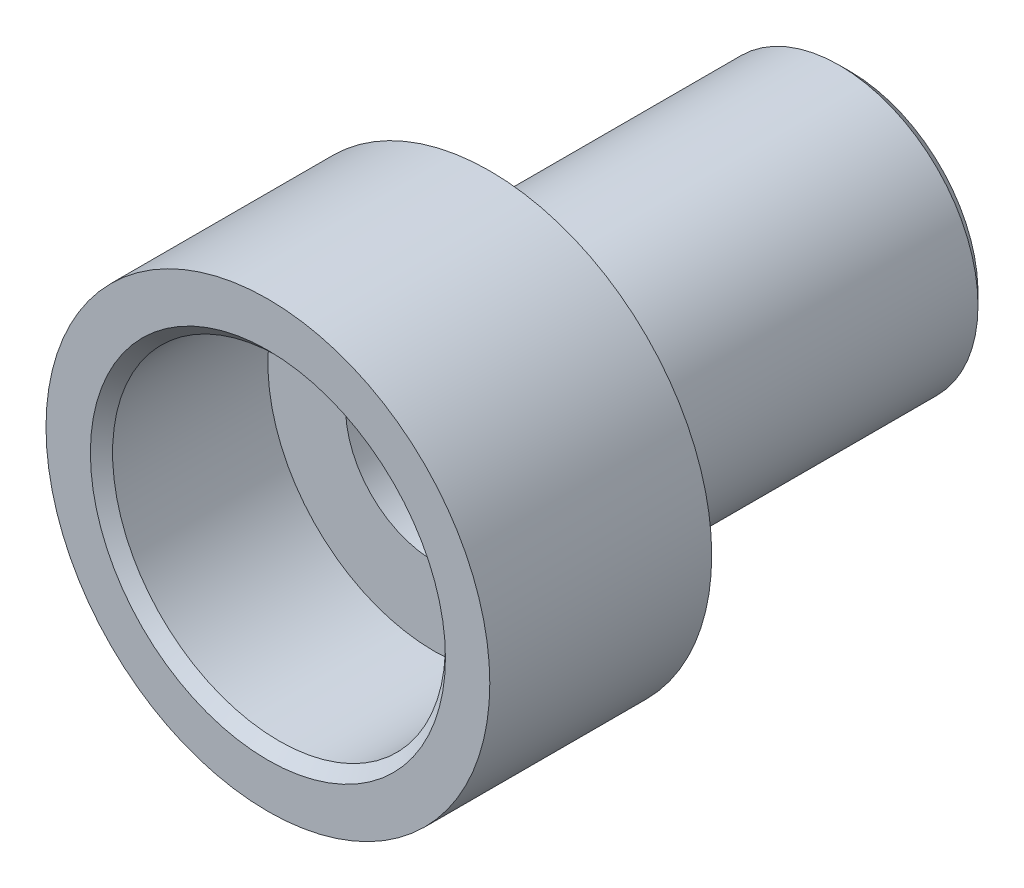
ISO-10303-21;
HEADER;
FILE_DESCRIPTION(('STEP AP214'),'2;1');
FILE_NAME('part.step','',(''),(''),'','','');
FILE_SCHEMA(('AUTOMOTIVE_DESIGN { 1 0 10303 214 1 1 1 1 }'));
ENDSEC;
DATA;
#1=APPLICATION_CONTEXT('core data for automotive mechanical design processes');
#2=APPLICATION_PROTOCOL_DEFINITION('international standard','automotive_design',2000,#1);
#3=PRODUCT_CONTEXT('',#1,'mechanical');
#4=PRODUCT('Part','Part','',(#3));
#5=PRODUCT_RELATED_PRODUCT_CATEGORY('part','',(#4));
#6=PRODUCT_DEFINITION_FORMATION('','',#4);
#7=PRODUCT_DEFINITION_CONTEXT('part definition',#1,'design');
#8=PRODUCT_DEFINITION('design','',#6,#7);
#9=PRODUCT_DEFINITION_SHAPE('','',#8);
#10=(LENGTH_UNIT() NAMED_UNIT(*) SI_UNIT(.MILLI.,.METRE.));
#11=(NAMED_UNIT(*) PLANE_ANGLE_UNIT() SI_UNIT($,.RADIAN.));
#12=(NAMED_UNIT(*) SI_UNIT($,.STERADIAN.) SOLID_ANGLE_UNIT());
#13=UNCERTAINTY_MEASURE_WITH_UNIT(LENGTH_MEASURE(1.E-05),#10,'distance_accuracy_value','');
#14=(GEOMETRIC_REPRESENTATION_CONTEXT(3) GLOBAL_UNCERTAINTY_ASSIGNED_CONTEXT((#13)) GLOBAL_UNIT_ASSIGNED_CONTEXT((#10,
#11,#12)) REPRESENTATION_CONTEXT('',''));
#15=CARTESIAN_POINT('',(0.,0.,0.));
#16=DIRECTION('',(0.,0.,1.));
#17=DIRECTION('',(1.,0.,0.));
#18=AXIS2_PLACEMENT_3D('',#15,#16,#17);
#19=CARTESIAN_POINT('',(36.5,36.5,4.));
#20=DIRECTION('',(0.,0.,-1.));
#21=DIRECTION('',(0.,1.,0.));
#22=AXIS2_PLACEMENT_3D('',#19,#20,#21);
#23=CYLINDRICAL_SURFACE('',#22,1.6);
#24=CARTESIAN_POINT('',(36.5,36.5,4.));
#25=DIRECTION('',(0.,0.,-1.));
#26=DIRECTION('',(0.,1.,0.));
#27=AXIS2_PLACEMENT_3D('',#24,#25,#26);
#28=CIRCLE('',#27,1.6);
#29=CARTESIAN_POINT('',(36.5,38.1,4.));
#30=VERTEX_POINT('',#29);
#31=EDGE_CURVE('E50',#30,#30,#28,.T.);
#32=ORIENTED_EDGE('',*,*,#31,.T.);
#33=EDGE_LOOP('',(#32));
#34=FACE_BOUND('',#33,.T.);
#35=CARTESIAN_POINT('',(36.5,36.5,11.5));
#36=DIRECTION('',(0.,0.,-1.));
#37=DIRECTION('',(0.,1.,0.));
#38=AXIS2_PLACEMENT_3D('',#35,#36,#37);
#39=CIRCLE('',#38,1.6);
#40=CARTESIAN_POINT('',(36.5,38.1,11.5));
#41=VERTEX_POINT('',#40);
#42=EDGE_CURVE('E65',#41,#41,#39,.T.);
#43=ORIENTED_EDGE('',*,*,#42,.F.);
#44=EDGE_LOOP('',(#43));
#45=FACE_BOUND('',#44,.T.);
#46=ADVANCED_FACE('F30',(#34,#45),#23,.F.);
#47=CARTESIAN_POINT('',(38.1,36.5,4.));
#48=DIRECTION('',(0.,0.,-1.));
#49=DIRECTION('',(0.,1.,0.));
#50=AXIS2_PLACEMENT_3D('',#47,#48,#49);
#51=PLANE('',#50);
#52=CARTESIAN_POINT('',(36.5,36.5,4.));
#53=DIRECTION('',(0.,0.,-1.));
#54=DIRECTION('',(0.,1.,0.));
#55=AXIS2_PLACEMENT_3D('',#52,#53,#54);
#56=CIRCLE('',#55,2.3);
#57=CARTESIAN_POINT('',(36.5,38.8,4.));
#58=VERTEX_POINT('',#57);
#59=EDGE_CURVE('E45',#58,#58,#56,.T.);
#60=ORIENTED_EDGE('',*,*,#59,.T.);
#61=EDGE_LOOP('',(#60));
#62=FACE_BOUND('',#61,.T.);
#63=ORIENTED_EDGE('',*,*,#31,.F.);
#64=EDGE_LOOP('',(#63));
#65=FACE_BOUND('',#64,.T.);
#66=ADVANCED_FACE('F73',(#62,#65),#51,.T.);
#67=CARTESIAN_POINT('',(36.5,36.5,4.));
#68=DIRECTION('',(0.,0.,-1.));
#69=DIRECTION('',(0.,1.,0.));
#70=AXIS2_PLACEMENT_3D('',#67,#68,#69);
#71=CYLINDRICAL_SURFACE('',#70,2.5);
#72=CARTESIAN_POINT('',(36.5,36.5,4.2));
#73=DIRECTION('',(0.,0.,-1.));
#74=DIRECTION('',(0.,1.,0.));
#75=AXIS2_PLACEMENT_3D('',#72,#73,#74);
#76=CIRCLE('',#75,2.5);
#77=CARTESIAN_POINT('',(36.5,39.,4.2));
#78=VERTEX_POINT('',#77);
#79=EDGE_CURVE('E41',#78,#78,#76,.F.);
#80=ORIENTED_EDGE('',*,*,#79,.T.);
#81=EDGE_LOOP('',(#80));
#82=FACE_BOUND('',#81,.T.);
#83=CARTESIAN_POINT('',(36.5,36.5,10.5));
#84=DIRECTION('',(0.,0.,-1.));
#85=DIRECTION('',(0.,1.,0.));
#86=AXIS2_PLACEMENT_3D('',#83,#84,#85);
#87=CIRCLE('',#86,2.5);
#88=CARTESIAN_POINT('',(36.5,39.,10.5));
#89=VERTEX_POINT('',#88);
#90=EDGE_CURVE('E53',#89,#89,#87,.T.);
#91=ORIENTED_EDGE('',*,*,#90,.T.);
#92=EDGE_LOOP('',(#91));
#93=FACE_BOUND('',#92,.T.);
#94=ADVANCED_FACE('F79',(#82,#93),#71,.T.);
#95=CARTESIAN_POINT('',(39.,36.5,10.5));
#96=DIRECTION('',(0.,0.,-1.));
#97=DIRECTION('',(0.,1.,0.));
#98=AXIS2_PLACEMENT_3D('',#95,#96,#97);
#99=PLANE('',#98);
#100=CARTESIAN_POINT('',(36.5,36.5,10.5));
#101=DIRECTION('',(0.,0.,-1.));
#102=DIRECTION('',(0.,1.,0.));
#103=AXIS2_PLACEMENT_3D('',#100,#101,#102);
#104=CIRCLE('',#103,4.);
#105=CARTESIAN_POINT('',(36.5,40.5,10.5));
#106=VERTEX_POINT('',#105);
#107=EDGE_CURVE('E56',#106,#106,#104,.T.);
#108=ORIENTED_EDGE('',*,*,#107,.T.);
#109=EDGE_LOOP('',(#108));
#110=FACE_BOUND('',#109,.T.);
#111=ORIENTED_EDGE('',*,*,#90,.F.);
#112=EDGE_LOOP('',(#111));
#113=FACE_BOUND('',#112,.T.);
#114=ADVANCED_FACE('F101',(#110,#113),#99,.T.);
#115=CARTESIAN_POINT('',(36.5,36.5,4.));
#116=DIRECTION('',(0.,0.,-1.));
#117=DIRECTION('',(0.,1.,0.));
#118=AXIS2_PLACEMENT_3D('',#115,#116,#117);
#119=CYLINDRICAL_SURFACE('',#118,4.);
#120=CARTESIAN_POINT('',(36.5,36.5,14.5));
#121=DIRECTION('',(0.,0.,-1.));
#122=DIRECTION('',(0.,1.,0.));
#123=AXIS2_PLACEMENT_3D('',#120,#121,#122);
#124=CIRCLE('',#123,4.);
#125=CARTESIAN_POINT('',(36.5,40.5,14.5));
#126=VERTEX_POINT('',#125);
#127=EDGE_CURVE('E59',#126,#126,#124,.T.);
#128=ORIENTED_EDGE('',*,*,#127,.T.);
#129=EDGE_LOOP('',(#128));
#130=FACE_BOUND('',#129,.T.);
#131=ORIENTED_EDGE('',*,*,#107,.F.);
#132=EDGE_LOOP('',(#131));
#133=FACE_BOUND('',#132,.T.);
#134=ADVANCED_FACE('F105',(#130,#133),#119,.T.);
#135=CARTESIAN_POINT('',(40.5,36.5,14.5));
#136=DIRECTION('',(0.,0.,1.));
#137=DIRECTION('',(0.,-1.,0.));
#138=AXIS2_PLACEMENT_3D('',#135,#136,#137);
#139=PLANE('',#138);
#140=CARTESIAN_POINT('',(36.5,36.5,14.5));
#141=DIRECTION('',(0.,0.,1.));
#142=DIRECTION('',(0.,-1.,0.));
#143=AXIS2_PLACEMENT_3D('',#140,#141,#142);
#144=CIRCLE('',#143,3.2);
#145=CARTESIAN_POINT('',(36.5,33.3,14.5));
#146=VERTEX_POINT('',#145);
#147=EDGE_CURVE('E37',#146,#146,#144,.F.);
#148=ORIENTED_EDGE('',*,*,#147,.T.);
#149=EDGE_LOOP('',(#148));
#150=FACE_BOUND('',#149,.T.);
#151=ORIENTED_EDGE('',*,*,#127,.F.);
#152=EDGE_LOOP('',(#151));
#153=FACE_BOUND('',#152,.T.);
#154=ADVANCED_FACE('F111',(#150,#153),#139,.T.);
#155=CARTESIAN_POINT('',(36.5,36.5,4.));
#156=DIRECTION('',(0.,0.,-1.));
#157=DIRECTION('',(0.,1.,0.));
#158=AXIS2_PLACEMENT_3D('',#155,#156,#157);
#159=CYLINDRICAL_SURFACE('',#158,3.);
#160=CARTESIAN_POINT('',(36.5,36.5,14.3));
#161=DIRECTION('',(0.,0.,1.));
#162=DIRECTION('',(0.,-1.,0.));
#163=AXIS2_PLACEMENT_3D('',#160,#161,#162);
#164=CIRCLE('',#163,3.);
#165=CARTESIAN_POINT('',(36.5,33.5,14.3));
#166=VERTEX_POINT('',#165);
#167=EDGE_CURVE('E10',#166,#166,#164,.T.);
#168=ORIENTED_EDGE('',*,*,#167,.T.);
#169=EDGE_LOOP('',(#168));
#170=FACE_BOUND('',#169,.T.);
#171=CARTESIAN_POINT('',(36.5,36.5,11.5));
#172=DIRECTION('',(0.,0.,-1.));
#173=DIRECTION('',(0.,1.,0.));
#174=AXIS2_PLACEMENT_3D('',#171,#172,#173);
#175=CIRCLE('',#174,3.);
#176=CARTESIAN_POINT('',(36.5,39.5,11.5));
#177=VERTEX_POINT('',#176);
#178=EDGE_CURVE('E62',#177,#177,#175,.T.);
#179=ORIENTED_EDGE('',*,*,#178,.T.);
#180=EDGE_LOOP('',(#179));
#181=FACE_BOUND('',#180,.T.);
#182=ADVANCED_FACE('F91',(#170,#181),#159,.F.);
#183=CARTESIAN_POINT('',(39.5,36.5,11.5));
#184=DIRECTION('',(0.,0.,1.));
#185=DIRECTION('',(0.,-1.,0.));
#186=AXIS2_PLACEMENT_3D('',#183,#184,#185);
#187=PLANE('',#186);
#188=ORIENTED_EDGE('',*,*,#42,.T.);
#189=EDGE_LOOP('',(#188));
#190=FACE_BOUND('',#189,.T.);
#191=ORIENTED_EDGE('',*,*,#178,.F.);
#192=EDGE_LOOP('',(#191));
#193=FACE_BOUND('',#192,.T.);
#194=ADVANCED_FACE('F69',(#190,#193),#187,.T.);
#195=CARTESIAN_POINT('',(36.5,36.5,4.));
#196=DIRECTION('',(0.,0.,1.));
#197=DIRECTION('',(0.,-1.,0.));
#198=AXIS2_PLACEMENT_3D('',#195,#196,#197);
#199=CONICAL_SURFACE('',#198,2.3,0.785398163397441);
#200=ORIENTED_EDGE('',*,*,#79,.F.);
#201=EDGE_LOOP('',(#200));
#202=FACE_BOUND('',#201,.T.);
#203=ORIENTED_EDGE('',*,*,#59,.F.);
#204=EDGE_LOOP('',(#203));
#205=FACE_BOUND('',#204,.T.);
#206=ADVANCED_FACE('F83',(#202,#205),#199,.T.);
#207=CARTESIAN_POINT('',(36.5,36.5,14.5));
#208=DIRECTION('',(0.,0.,1.));
#209=DIRECTION('',(0.,-1.,0.));
#210=AXIS2_PLACEMENT_3D('',#207,#208,#209);
#211=CONICAL_SURFACE('',#210,3.2,0.785398163397442);
#212=ORIENTED_EDGE('',*,*,#167,.F.);
#213=EDGE_LOOP('',(#212));
#214=FACE_BOUND('',#213,.T.);
#215=ORIENTED_EDGE('',*,*,#147,.F.);
#216=EDGE_LOOP('',(#215));
#217=FACE_BOUND('',#216,.T.);
#218=ADVANCED_FACE('F32',(#214,#217),#211,.F.);
#219=CLOSED_SHELL('',(#46,#66,#94,#114,#134,#154,#182,#194,#206,#218));
#220=MANIFOLD_SOLID_BREP('B2',#219);
#221=ADVANCED_BREP_SHAPE_REPRESENTATION('',(#18,#220),#14);
#222=SHAPE_DEFINITION_REPRESENTATION(#9,#221);
ENDSEC;
END-ISO-10303-21;
